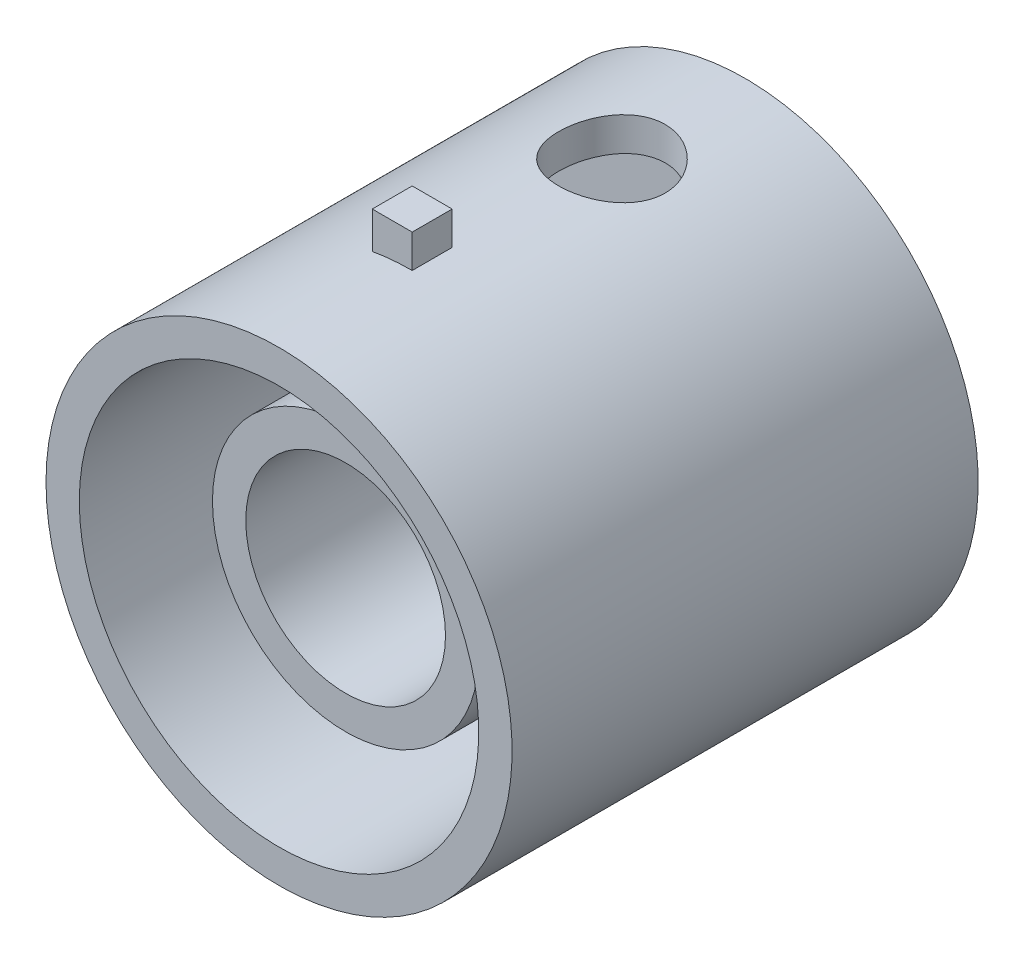
ISO-10303-21;
HEADER;
FILE_DESCRIPTION(('STEP AP214'),'2;1');
FILE_NAME('part.step','',(''),(''),'','','');
FILE_SCHEMA(('AUTOMOTIVE_DESIGN { 1 0 10303 214 1 1 1 1 }'));
ENDSEC;
DATA;
#1=APPLICATION_CONTEXT('core data for automotive mechanical design processes');
#2=APPLICATION_PROTOCOL_DEFINITION('international standard','automotive_design',2000,#1);
#3=PRODUCT_CONTEXT('',#1,'mechanical');
#4=PRODUCT('Part','Part','',(#3));
#5=PRODUCT_RELATED_PRODUCT_CATEGORY('part','',(#4));
#6=PRODUCT_DEFINITION_FORMATION('','',#4);
#7=PRODUCT_DEFINITION_CONTEXT('part definition',#1,'design');
#8=PRODUCT_DEFINITION('design','',#6,#7);
#9=PRODUCT_DEFINITION_SHAPE('','',#8);
#10=(LENGTH_UNIT() NAMED_UNIT(*) SI_UNIT(.MILLI.,.METRE.));
#11=(NAMED_UNIT(*) PLANE_ANGLE_UNIT() SI_UNIT($,.RADIAN.));
#12=(NAMED_UNIT(*) SI_UNIT($,.STERADIAN.) SOLID_ANGLE_UNIT());
#13=UNCERTAINTY_MEASURE_WITH_UNIT(LENGTH_MEASURE(1.E-05),#10,'distance_accuracy_value','');
#14=(GEOMETRIC_REPRESENTATION_CONTEXT(3) GLOBAL_UNCERTAINTY_ASSIGNED_CONTEXT((#13)) GLOBAL_UNIT_ASSIGNED_CONTEXT((#10,
#11,#12)) REPRESENTATION_CONTEXT('',''));
#15=CARTESIAN_POINT('',(0.,0.,0.));
#16=DIRECTION('',(0.,0.,1.));
#17=DIRECTION('',(1.,0.,0.));
#18=AXIS2_PLACEMENT_3D('',#15,#16,#17);
#19=CARTESIAN_POINT('',(0.,0.,35.));
#20=DIRECTION('',(0.,0.,-1.));
#21=DIRECTION('',(-1.,0.,0.));
#22=AXIS2_PLACEMENT_3D('',#19,#20,#21);
#23=CYLINDRICAL_SURFACE('',#22,15.);
#24=CARTESIAN_POINT('',(0.,0.,35.));
#25=DIRECTION('',(0.,0.,-1.));
#26=DIRECTION('',(-1.,0.,0.));
#27=AXIS2_PLACEMENT_3D('',#24,#25,#26);
#28=CIRCLE('',#27,15.);
#29=CARTESIAN_POINT('',(-15.,0.,35.));
#30=VERTEX_POINT('',#29);
#31=EDGE_CURVE('E215',#30,#30,#28,.T.);
#32=ORIENTED_EDGE('',*,*,#31,.F.);
#33=EDGE_LOOP('',(#32));
#34=FACE_BOUND('',#33,.T.);
#35=CARTESIAN_POINT('',(0.,0.,5.));
#36=DIRECTION('',(0.,0.,-1.));
#37=DIRECTION('',(-1.,0.,0.));
#38=AXIS2_PLACEMENT_3D('',#35,#36,#37);
#39=CIRCLE('',#38,15.);
#40=CARTESIAN_POINT('',(-15.,0.,5.));
#41=VERTEX_POINT('',#40);
#42=EDGE_CURVE('E219',#41,#41,#39,.T.);
#43=ORIENTED_EDGE('',*,*,#42,.T.);
#44=EDGE_LOOP('',(#43));
#45=FACE_BOUND('',#44,.T.);
#46=CARTESIAN_POINT('',(0.,15.,6.));
#47=CARTESIAN_POINT('',(-0.220509111665708,14.9999966762032,6.00000523386971));
#48=CARTESIAN_POINT('',(-0.44107432044368,14.995089723243,6.01829522837935));
#49=CARTESIAN_POINT('',(-0.875850902708927,14.9759914724332,6.09084246147739));
#50=CARTESIAN_POINT('',(-1.09005916663817,14.9617957066517,6.14511700885223));
#51=CARTESIAN_POINT('',(-1.50578317809062,14.9256866650558,6.28774333372807));
#52=CARTESIAN_POINT('',(-1.70731490203057,14.9037833426075,6.37605117533204));
#53=CARTESIAN_POINT('',(-2.09270737278532,14.8545739830336,6.58407448533324));
#54=CARTESIAN_POINT('',(-2.27656694089925,14.8272675859036,6.70379204671858));
#55=CARTESIAN_POINT('',(-2.62565900748003,14.7694922980399,6.97416703282674));
#56=CARTESIAN_POINT('',(-2.79042337972557,14.7389693535736,7.12541733601653));
#57=CARTESIAN_POINT('',(-3.09257427321275,14.6785481935918,7.45329696612671));
#58=CARTESIAN_POINT('',(-3.22995726991329,14.6486500589449,7.62992955523505));
#59=CARTESIAN_POINT('',(-3.4757281848683,14.5923107492874,8.0072964696509));
#60=CARTESIAN_POINT('',(-3.58357755472975,14.5659377712648,8.20839265652346));
#61=CARTESIAN_POINT('',(-3.76375096153988,14.5204295463637,8.62668022218485));
#62=CARTESIAN_POINT('',(-3.83608154902738,14.5012929650653,8.84386862466288));
#63=CARTESIAN_POINT('',(-3.94153840453008,14.472982316048,9.28299107565003));
#64=CARTESIAN_POINT('',(-3.97551340489383,14.4635929562298,9.50470707986147));
#65=CARTESIAN_POINT('',(-4.00594069411639,14.4551966183274,9.95087536661308));
#66=CARTESIAN_POINT('',(-4.00239999411507,14.4561877002889,10.1753271300481));
#67=CARTESIAN_POINT('',(-3.95857020005398,14.4682475760406,10.6139708307481));
#68=CARTESIAN_POINT('',(-3.91930812129529,14.4790347102306,10.828274364077));
#69=CARTESIAN_POINT('',(-3.80679497444366,14.5090202616138,11.2471366689125));
#70=CARTESIAN_POINT('',(-3.7335411898599,14.5282193510522,11.4516946601507));
#71=CARTESIAN_POINT('',(-3.55428713930512,14.5731132349677,11.8479362876172));
#72=CARTESIAN_POINT('',(-3.44792682275569,14.5988788563741,12.0394486785725));
#73=CARTESIAN_POINT('',(-3.20573007647555,14.6539645928489,12.4022683177031));
#74=CARTESIAN_POINT('',(-3.06988784448503,14.6832854071037,12.5735715783129));
#75=CARTESIAN_POINT('',(-2.76733214526838,14.7433502125973,12.8969779949096));
#76=CARTESIAN_POINT('',(-2.59975625456598,14.7741094297766,13.0482726366299));
#77=CARTESIAN_POINT('',(-2.24123533641274,14.8327276255263,13.3207775607006));
#78=CARTESIAN_POINT('',(-2.05028938841018,14.8605864897711,13.4419866574049));
#79=CARTESIAN_POINT('',(-1.6491965109949,14.9104364079659,13.6512358056493));
#80=CARTESIAN_POINT('',(-1.43896980510358,14.9324014566712,13.7391295408972));
#81=CARTESIAN_POINT('',(-1.00600458878079,14.96780088802,13.8780943776267));
#82=CARTESIAN_POINT('',(-0.783268823856647,14.981237134675,13.9291735254479));
#83=CARTESIAN_POINT('',(-0.338508166291031,14.9977831711677,13.9917897538357));
#84=CARTESIAN_POINT('',(-0.116648475282761,15.0011799494192,14.0044260797017));
#85=CARTESIAN_POINT('',(0.326020091802396,14.9980894338339,13.9928336715061));
#86=CARTESIAN_POINT('',(0.546829074124226,14.9916031616071,13.9686087477885));
#87=CARTESIAN_POINT('',(0.977204899803558,14.9696607099204,13.88488310508));
#88=CARTESIAN_POINT('',(1.18689970405556,14.9543605309265,13.8259955076045));
#89=CARTESIAN_POINT('',(1.59341394235213,14.9165258978828,13.6753281109841));
#90=CARTESIAN_POINT('',(1.79023197843205,14.8939906599234,13.5835447474989));
#91=CARTESIAN_POINT('',(2.1696769493359,14.8435132111904,13.3676522256389));
#92=CARTESIAN_POINT('',(2.35195037692236,14.8154737320985,13.2429450664045));
#93=CARTESIAN_POINT('',(2.6933692707943,14.7572290473119,12.965496739684));
#94=CARTESIAN_POINT('',(2.85251015759837,14.7270234145527,12.8127500347979));
#95=CARTESIAN_POINT('',(3.14777848957546,14.6667949173317,12.4784288450108));
#96=CARTESIAN_POINT('',(3.28313038499627,14.6368012285772,12.2961628772095));
#97=CARTESIAN_POINT('',(3.52134382370242,14.5813289436636,11.9108706078009));
#98=CARTESIAN_POINT('',(3.62420672244342,14.5558501591602,11.7078451727561));
#99=CARTESIAN_POINT('',(3.79374823172204,14.5125853674305,11.2878093858471));
#100=CARTESIAN_POINT('',(3.8606362450784,14.4947549662348,11.0708883763624));
#101=CARTESIAN_POINT('',(3.95682410237657,14.4687965026614,10.6283213606529));
#102=CARTESIAN_POINT('',(3.98613355205236,14.4606659608681,10.4026775993132));
#103=CARTESIAN_POINT('',(4.00577979307212,14.4552348910192,9.95701042421141));
#104=CARTESIAN_POINT('',(3.99736311235129,14.4575879532022,9.73704535942668));
#105=CARTESIAN_POINT('',(3.94468751999858,14.4720479199639,9.3017929719295));
#106=CARTESIAN_POINT('',(3.9004295306998,14.4841545735456,9.08650552899045));
#107=CARTESIAN_POINT('',(3.77805031399794,14.5165514219021,8.66828849575977));
#108=CARTESIAN_POINT('',(3.70019322151266,14.5367777005106,8.46527631454086));
#109=CARTESIAN_POINT('',(3.51303109124666,14.5831363626058,8.0750423389265));
#110=CARTESIAN_POINT('',(3.40372112049204,14.6092696723953,7.8878230273976));
#111=CARTESIAN_POINT('',(3.15297818537663,14.6654584288421,7.52853928100823));
#112=CARTESIAN_POINT('',(3.01069459535826,14.6956066620426,7.35708293004797));
#113=CARTESIAN_POINT('',(2.69966107022192,14.7559100756513,7.04007509666496));
#114=CARTESIAN_POINT('',(2.53090470871747,14.7860652559664,6.89452992266221));
#115=CARTESIAN_POINT('',(2.16735996217739,14.8437562480818,6.63041552470639));
#116=CARTESIAN_POINT('',(1.97209192350356,14.8712222262917,6.51248997870138));
#117=CARTESIAN_POINT('',(1.56377728083377,14.9196762020573,6.31132516814125));
#118=CARTESIAN_POINT('',(1.35074218939259,14.9406683536717,6.2280636486728));
#119=CARTESIAN_POINT('',(0.948749409761982,14.9710950502695,6.10944942916897));
#120=CARTESIAN_POINT('',(0.761524033130071,14.9818554118521,6.06850123281501));
#121=CARTESIAN_POINT('',(0.382879590634151,14.9963089807291,6.01377558766588));
#122=CARTESIAN_POINT('',(0.19146094080972,15.0000028859454,5.99999545559995));
#123=CARTESIAN_POINT('',(0.,15.,6.));
#124=B_SPLINE_CURVE_WITH_KNOTS('',3,(#46,#47,#48,#49,#50,#51,#52,#53,#54,#55,#56,#57,#58,#59,
#60,#61,#62,#63,#64,#65,#66,#67,#68,#69,#70,#71,#72,#73,#74,#75,#76,#77,#78,#79,#80,#81,#82,#83,
#84,#85,#86,#87,#88,#89,#90,#91,#92,#93,#94,#95,#96,#97,#98,#99,#100,#101,#102,#103,#104,#105,
#106,#107,#108,#109,#110,#111,#112,#113,#114,#115,#116,#117,#118,#119,#120,#121,#122,#123),
.UNSPECIFIED.,.T.,.F.,(4,2,2,2,2,2,2,2,2,2,2,2,2,2,2,2,2,2,2,2,2,2,2,2,2,2,2,2,2,2,2,2,2,2,2,2,
2,2,4),(0.,0.660825197899138,1.3219684875229,1.98226110594386,2.6425977341735,3.31669795909934,
3.99088489850298,4.67665165046458,5.36229188259399,6.03244316500936,6.70246920808639,
7.35382004091993,8.00522293625879,8.66397346692996,9.32285376235259,10.0032251962464,
10.6836234387519,11.3669761920608,12.0501795438028,12.7136543504909,13.377060578507,
14.0290707128423,14.6811515155123,15.346005720091,16.0109913651777,16.6947299276558,
17.3784399604821,18.0581259539877,18.7376381732796,19.394866848109,20.0520786104837,
20.7042153090379,21.3564543425319,22.0278867914997,22.6994824867208,23.3854450456898,
24.0709665229755,24.6447963799386,25.2185695593995),.UNSPECIFIED.);
#125=CARTESIAN_POINT('',(0.,15.,6.));
#126=VERTEX_POINT('',#125);
#127=EDGE_CURVE('E162',#126,#126,#124,.T.);
#128=ORIENTED_EDGE('',*,*,#127,.T.);
#129=EDGE_LOOP('',(#128));
#130=FACE_BOUND('',#129,.T.);
#131=ADVANCED_FACE('F54',(#34,#45,#130),#23,.F.);
#132=CARTESIAN_POINT('',(0.,0.,35.));
#133=DIRECTION('',(0.,0.,-1.));
#134=DIRECTION('',(-1.,0.,0.));
#135=AXIS2_PLACEMENT_3D('',#132,#133,#134);
#136=CYLINDRICAL_SURFACE('',#135,17.5);
#137=CARTESIAN_POINT('',(0.,0.,0.));
#138=DIRECTION('',(0.,0.,-1.));
#139=DIRECTION('',(-1.,0.,0.));
#140=AXIS2_PLACEMENT_3D('',#137,#138,#139);
#141=CIRCLE('',#140,17.5);
#142=CARTESIAN_POINT('',(-17.5,0.,0.));
#143=VERTEX_POINT('',#142);
#144=EDGE_CURVE('E207',#143,#143,#141,.T.);
#145=ORIENTED_EDGE('',*,*,#144,.F.);
#146=EDGE_LOOP('',(#145));
#147=FACE_BOUND('',#146,.T.);
#148=CARTESIAN_POINT('',(0.,0.,35.));
#149=DIRECTION('',(0.,0.,-1.));
#150=DIRECTION('',(-1.,0.,0.));
#151=AXIS2_PLACEMENT_3D('',#148,#149,#150);
#152=CIRCLE('',#151,17.5);
#153=CARTESIAN_POINT('',(-17.5,0.,35.));
#154=VERTEX_POINT('',#153);
#155=EDGE_CURVE('E211',#154,#154,#152,.T.);
#156=ORIENTED_EDGE('',*,*,#155,.T.);
#157=EDGE_LOOP('',(#156));
#158=FACE_BOUND('',#157,.T.);
#159=CARTESIAN_POINT('',(0.,0.,22.));
#160=DIRECTION('',(0.,0.,-1.));
#161=DIRECTION('',(-1.,0.,0.));
#162=AXIS2_PLACEMENT_3D('',#159,#160,#161);
#163=CIRCLE('',#162,17.5);
#164=CARTESIAN_POINT('',(0.,17.5,22.));
#165=VERTEX_POINT('',#164);
#166=CARTESIAN_POINT('',(-3.,17.2409396495667,22.));
#167=VERTEX_POINT('',#166);
#168=EDGE_CURVE('E244',#165,#167,#163,.F.);
#169=ORIENTED_EDGE('',*,*,#168,.F.);
#170=DIRECTION('',(0.,0.,-1.));
#171=VECTOR('',#170,1.);
#172=CARTESIAN_POINT('',(0.,17.5,35.));
#173=LINE('',#172,#171);
#174=CARTESIAN_POINT('',(0.,17.5,25.));
#175=VERTEX_POINT('',#174);
#176=EDGE_CURVE('E238',#175,#165,#173,.T.);
#177=ORIENTED_EDGE('',*,*,#176,.F.);
#178=CARTESIAN_POINT('',(0.,0.,25.));
#179=DIRECTION('',(0.,0.,-1.));
#180=DIRECTION('',(-1.,0.,0.));
#181=AXIS2_PLACEMENT_3D('',#178,#179,#180);
#182=CIRCLE('',#181,17.5);
#183=CARTESIAN_POINT('',(-3.,17.2409396495667,25.));
#184=VERTEX_POINT('',#183);
#185=EDGE_CURVE('E234',#175,#184,#182,.F.);
#186=ORIENTED_EDGE('',*,*,#185,.T.);
#187=DIRECTION('',(0.,0.,-1.));
#188=VECTOR('',#187,1.);
#189=CARTESIAN_POINT('',(-3.,17.2409396495667,35.));
#190=LINE('',#189,#188);
#191=EDGE_CURVE('E241',#167,#184,#190,.F.);
#192=ORIENTED_EDGE('',*,*,#191,.F.);
#193=EDGE_LOOP('',(#169,#177,#186,#192));
#194=FACE_BOUND('',#193,.T.);
#195=CARTESIAN_POINT('',(0.,0.,22.));
#196=DIRECTION('',(0.,0.,-1.));
#197=DIRECTION('',(-1.,0.,0.));
#198=AXIS2_PLACEMENT_3D('',#195,#196,#197);
#199=CIRCLE('',#198,17.5);
#200=CARTESIAN_POINT('',(-3.,-17.2409396495667,22.));
#201=VERTEX_POINT('',#200);
#202=CARTESIAN_POINT('',(0.,-17.5,22.));
#203=VERTEX_POINT('',#202);
#204=EDGE_CURVE('E13',#201,#203,#199,.F.);
#205=ORIENTED_EDGE('',*,*,#204,.F.);
#206=DIRECTION('',(0.,0.,-1.));
#207=VECTOR('',#206,1.);
#208=CARTESIAN_POINT('',(-3.,-17.2409396495667,35.));
#209=LINE('',#208,#207);
#210=CARTESIAN_POINT('',(-3.,-17.2409396495667,25.));
#211=VERTEX_POINT('',#210);
#212=EDGE_CURVE('E69',#211,#201,#209,.T.);
#213=ORIENTED_EDGE('',*,*,#212,.F.);
#214=CARTESIAN_POINT('',(0.,0.,25.));
#215=DIRECTION('',(0.,0.,-1.));
#216=DIRECTION('',(-1.,0.,0.));
#217=AXIS2_PLACEMENT_3D('',#214,#215,#216);
#218=CIRCLE('',#217,17.5);
#219=CARTESIAN_POINT('',(0.,-17.5,25.));
#220=VERTEX_POINT('',#219);
#221=EDGE_CURVE('E247',#211,#220,#218,.F.);
#222=ORIENTED_EDGE('',*,*,#221,.T.);
#223=DIRECTION('',(0.,0.,-1.));
#224=VECTOR('',#223,1.);
#225=CARTESIAN_POINT('',(0.,-17.5,35.));
#226=LINE('',#225,#224);
#227=EDGE_CURVE('E251',#203,#220,#226,.F.);
#228=ORIENTED_EDGE('',*,*,#227,.F.);
#229=EDGE_LOOP('',(#205,#213,#222,#228));
#230=FACE_BOUND('',#229,.T.);
#231=CARTESIAN_POINT('',(0.,17.5,6.));
#232=CARTESIAN_POINT('',(0.221594935282783,17.499995968068,6.00000719840746));
#233=CARTESIAN_POINT('',(0.443274756959128,17.4957485358512,6.01847623471597));
#234=CARTESIAN_POINT('',(0.880320521290673,17.4792153051271,6.09177753277479));
#235=CARTESIAN_POINT('',(1.09568213303245,17.4669241214815,6.14663415565499));
#236=CARTESIAN_POINT('',(1.51371360660757,17.4356696772318,6.29088913749491));
#237=CARTESIAN_POINT('',(1.7163970515423,17.4167137065161,6.38024976670637));
#238=CARTESIAN_POINT('',(2.10389021634727,17.3741673572337,6.59085236871805));
#239=CARTESIAN_POINT('',(2.28870007051439,17.3505770134924,6.7120941019476));
#240=CARTESIAN_POINT('',(2.63842568761195,17.3008795298367,6.98525220984049));
#241=CARTESIAN_POINT('',(2.8029853970679,17.2747388181941,7.1376183686492));
#242=CARTESIAN_POINT('',(3.1044499115144,17.223119203773,7.46773538936754));
#243=CARTESIAN_POINT('',(3.24135206502983,17.1976403646508,7.64548868230576));
#244=CARTESIAN_POINT('',(3.48521732049751,17.1498961972962,8.02400656213501));
#245=CARTESIAN_POINT('',(3.59179558541503,17.1276737744502,8.22502498325686));
#246=CARTESIAN_POINT('',(3.76951731339888,17.0894428847913,8.64271187160798));
#247=CARTESIAN_POINT('',(3.84066543543489,17.0734336010283,8.85937827687622));
#248=CARTESIAN_POINT('',(3.94431902613062,17.0497845472768,9.29833190184522));
#249=CARTESIAN_POINT('',(3.9774579308818,17.0420077545908,9.52046199903834));
#250=CARTESIAN_POINT('',(4.00612307635684,17.035293111181,9.96725457890033));
#251=CARTESIAN_POINT('',(4.00165438345226,17.0363540698644,10.1919167163888));
#252=CARTESIAN_POINT('',(3.95573961410788,17.0470712601244,10.6326439188653));
#253=CARTESIAN_POINT('',(3.91503498212017,17.0565551364498,10.8487910593008));
#254=CARTESIAN_POINT('',(3.7989808959904,17.0827764200256,11.2711049365832));
#255=CARTESIAN_POINT('',(3.72362933860985,17.0995142676242,11.4772710666939));
#256=CARTESIAN_POINT('',(3.53975448878011,17.138523865828,11.8758258646808));
#257=CARTESIAN_POINT('',(3.43095096279258,17.1608420572298,12.0680805104346));
#258=CARTESIAN_POINT('',(3.18345740925708,17.2084698633587,12.4318752551479));
#259=CARTESIAN_POINT('',(3.04476295504351,17.2337799209123,12.6034122800757));
#260=CARTESIAN_POINT('',(2.73752505065933,17.2852750505473,12.9251654878448));
#261=CARTESIAN_POINT('',(2.56835251342571,17.3114666500678,13.0747805611737));
#262=CARTESIAN_POINT('',(2.20701546217961,17.3612295344905,13.3436196053461));
#263=CARTESIAN_POINT('',(2.01485045400194,17.3848007630533,13.4628429228231));
#264=CARTESIAN_POINT('',(1.61221242808024,17.4267550028416,13.6676840640452));
#265=CARTESIAN_POINT('',(1.4016950092806,17.4451249475635,13.7532174599674));
#266=CARTESIAN_POINT('',(0.968760585223054,17.4745105073269,13.8875246689492));
#267=CARTESIAN_POINT('',(0.746345479589441,17.485527292635,13.9363043315818));
#268=CARTESIAN_POINT('',(0.301080239392927,17.4987966671339,13.9948319789069));
#269=CARTESIAN_POINT('',(0.0783432719554244,17.5012334233894,14.0054002910742));
#270=CARTESIAN_POINT('',(-0.365714036026687,17.4975868145157,13.9894366706773));
#271=CARTESIAN_POINT('',(-0.58703448077231,17.4915040834974,13.9629074993023));
#272=CARTESIAN_POINT('',(-1.01921828270224,17.4716187460405,13.874181179832));
#273=CARTESIAN_POINT('',(-1.23017576869971,17.4579104431039,13.8124195096374));
#274=CARTESIAN_POINT('',(-1.63873374864027,17.4243107905876,13.6554689592337));
#275=CARTESIAN_POINT('',(-1.83633303329064,17.4044188821279,13.5602770574683));
#276=CARTESIAN_POINT('',(-2.21591921812758,17.3602077001317,13.337495264924));
#277=CARTESIAN_POINT('',(-2.39761969440068,17.3358251156802,13.2094302021116));
#278=CARTESIAN_POINT('',(-2.73724492155052,17.2854568565593,12.9251574270327));
#279=CARTESIAN_POINT('',(-2.89516627399103,17.2594709534956,12.7689456991294));
#280=CARTESIAN_POINT('',(-3.18603583539193,17.2081804262773,12.4290347366439));
#281=CARTESIAN_POINT('',(-3.31841356091017,17.1829002549519,12.2448429233595));
#282=CARTESIAN_POINT('',(-3.55036421684567,17.1364804485464,11.8563632212505));
#283=CARTESIAN_POINT('',(-3.64993860087588,17.115340630012,11.652076223424));
#284=CARTESIAN_POINT('',(-3.81275583687656,17.0798080231766,11.2303175047898));
#285=CARTESIAN_POINT('',(-3.87620881551104,17.0653763043275,11.0129303466466));
#286=CARTESIAN_POINT('',(-3.96558236920152,17.0448320064026,10.5702029459794));
#287=CARTESIAN_POINT('',(-3.99150958975625,17.038717954349,10.344864118872));
#288=CARTESIAN_POINT('',(-4.0047928491744,17.0356000555771,9.89839697706551));
#289=CARTESIAN_POINT('',(-3.99305540805986,17.0383820905001,9.67729665533734));
#290=CARTESIAN_POINT('',(-3.9333836212789,17.0522553971543,9.24031509907753));
#291=CARTESIAN_POINT('',(-3.88544978624981,17.0633465516653,9.02443379096346));
#292=CARTESIAN_POINT('',(-3.75520174667951,17.0924793729435,8.60481846015926));
#293=CARTESIAN_POINT('',(-3.67303100198937,17.1104920130225,8.4010377574185));
#294=CARTESIAN_POINT('',(-3.47676086584632,17.1514471657162,8.01002420328945));
#295=CARTESIAN_POINT('',(-3.3626578016596,17.1743902453407,7.82279325865276));
#296=CARTESIAN_POINT('',(-3.10280513424774,17.2232520455791,7.46575133378238));
#297=CARTESIAN_POINT('',(-2.95641450406339,17.2492251279843,7.29641424047297));
#298=CARTESIAN_POINT('',(-2.63742660785007,17.3008680931784,6.98441260097407));
#299=CARTESIAN_POINT('',(-2.46482325514099,17.3265379040506,6.84175426689248));
#300=CARTESIAN_POINT('',(-2.09530030913021,17.3751231383439,6.58517312157907));
#301=CARTESIAN_POINT('',(-1.89806528208061,17.3979933821164,6.4716955030268));
#302=CARTESIAN_POINT('',(-1.48683089541921,17.4379432084139,6.27968545758628));
#303=CARTESIAN_POINT('',(-1.27284515414195,17.4550274359953,6.20112498305501));
#304=CARTESIAN_POINT('',(-0.882343223138205,17.47858702453,6.09448611113966));
#305=CARTESIAN_POINT('',(-0.707870008416512,17.4865655617845,6.05912403316657));
#306=CARTESIAN_POINT('',(-0.355615969967494,17.4972735296406,6.01187870525145));
#307=CARTESIAN_POINT('',(-0.177835320323118,17.5000032357234,5.99999422310309));
#308=CARTESIAN_POINT('',(0.,17.5,6.));
#309=B_SPLINE_CURVE_WITH_KNOTS('',3,(#231,#232,#233,#234,#235,#236,#237,#238,#239,#240,#241,
#242,#243,#244,#245,#246,#247,#248,#249,#250,#251,#252,#253,#254,#255,#256,#257,#258,#259,#260,
#261,#262,#263,#264,#265,#266,#267,#268,#269,#270,#271,#272,#273,#274,#275,#276,#277,#278,#279,
#280,#281,#282,#283,#284,#285,#286,#287,#288,#289,#290,#291,#292,#293,#294,#295,#296,#297,#298,
#299,#300,#301,#302,#303,#304,#305,#306,#307,#308),.UNSPECIFIED.,.T.,.F.,(4,2,2,2,2,2,2,2,2,2,2,
2,2,2,2,2,2,2,2,2,2,2,2,2,2,2,2,2,2,2,2,2,2,2,2,2,2,2,4),(0.,0.664133636950417,1.32871235418463,
1.99256641063926,2.6564154787027,3.3306394824578,4.00492809209305,4.6874268949088,
5.36983592723062,6.04069914231538,6.71147198236624,7.3688273923675,8.02622271233902,
8.68928255518439,9.35244066073913,10.0313033386907,10.7101806097055,11.3907485024342,
12.071208055884,12.7369696485043,13.4026816907039,14.0603384109987,14.7180545882069,
15.3858732303227,16.0537872245365,16.7352268957805,17.4166363663565,18.0940403124228,
18.7713242812165,19.4324306212132,20.0935276348865,20.7518819365842,21.4103119908293,
22.0832282229975,22.7563009481092,23.4391031988252,24.1213559842544,24.6543673418573,
25.1873507239626),.UNSPECIFIED.);
#310=CARTESIAN_POINT('',(0.,17.5,6.));
#311=VERTEX_POINT('',#310);
#312=EDGE_CURVE('E58',#311,#311,#309,.T.);
#313=ORIENTED_EDGE('',*,*,#312,.T.);
#314=EDGE_LOOP('',(#313));
#315=FACE_BOUND('',#314,.T.);
#316=ADVANCED_FACE('F323',(#147,#158,#194,#230,#315),#136,.T.);
#317=CARTESIAN_POINT('',(0.,0.,35.));
#318=DIRECTION('',(0.,0.,-1.));
#319=DIRECTION('',(-1.,0.,0.));
#320=AXIS2_PLACEMENT_3D('',#317,#318,#319);
#321=CYLINDRICAL_SURFACE('',#320,7.5);
#322=CARTESIAN_POINT('',(0.,0.,5.));
#323=DIRECTION('',(0.,0.,-1.));
#324=DIRECTION('',(-1.,0.,0.));
#325=AXIS2_PLACEMENT_3D('',#322,#323,#324);
#326=CIRCLE('',#325,7.5);
#327=CARTESIAN_POINT('',(-7.5,0.,5.));
#328=VERTEX_POINT('',#327);
#329=EDGE_CURVE('E192',#328,#328,#326,.T.);
#330=ORIENTED_EDGE('',*,*,#329,.T.);
#331=EDGE_LOOP('',(#330));
#332=FACE_BOUND('',#331,.T.);
#333=CARTESIAN_POINT('',(0.,0.,30.));
#334=DIRECTION('',(0.,0.,-1.));
#335=DIRECTION('',(-1.,0.,0.));
#336=AXIS2_PLACEMENT_3D('',#333,#334,#335);
#337=CIRCLE('',#336,7.5);
#338=CARTESIAN_POINT('',(-7.5,0.,30.));
#339=VERTEX_POINT('',#338);
#340=EDGE_CURVE('E231',#339,#339,#337,.T.);
#341=ORIENTED_EDGE('',*,*,#340,.F.);
#342=EDGE_LOOP('',(#341));
#343=FACE_BOUND('',#342,.T.);
#344=ADVANCED_FACE('F56',(#332,#343),#321,.F.);
#345=CARTESIAN_POINT('',(10.,0.,30.));
#346=DIRECTION('',(0.,0.,1.));
#347=DIRECTION('',(1.,0.,0.));
#348=AXIS2_PLACEMENT_3D('',#345,#346,#347);
#349=PLANE('',#348);
#350=ORIENTED_EDGE('',*,*,#340,.T.);
#351=EDGE_LOOP('',(#350));
#352=FACE_BOUND('',#351,.T.);
#353=CARTESIAN_POINT('',(0.,0.,30.));
#354=DIRECTION('',(0.,0.,-1.));
#355=DIRECTION('',(-1.,0.,0.));
#356=AXIS2_PLACEMENT_3D('',#353,#354,#355);
#357=CIRCLE('',#356,10.);
#358=CARTESIAN_POINT('',(-10.,0.,30.));
#359=VERTEX_POINT('',#358);
#360=EDGE_CURVE('E227',#359,#359,#357,.T.);
#361=ORIENTED_EDGE('',*,*,#360,.F.);
#362=EDGE_LOOP('',(#361));
#363=FACE_BOUND('',#362,.T.);
#364=ADVANCED_FACE('F352',(#352,#363),#349,.T.);
#365=CARTESIAN_POINT('',(0.,0.,35.));
#366=DIRECTION('',(0.,0.,-1.));
#367=DIRECTION('',(-1.,0.,0.));
#368=AXIS2_PLACEMENT_3D('',#365,#366,#367);
#369=CYLINDRICAL_SURFACE('',#368,10.);
#370=ORIENTED_EDGE('',*,*,#360,.T.);
#371=EDGE_LOOP('',(#370));
#372=FACE_BOUND('',#371,.T.);
#373=CARTESIAN_POINT('',(0.,0.,5.));
#374=DIRECTION('',(0.,0.,-1.));
#375=DIRECTION('',(-1.,0.,0.));
#376=AXIS2_PLACEMENT_3D('',#373,#374,#375);
#377=CIRCLE('',#376,10.);
#378=CARTESIAN_POINT('',(-10.,0.,5.));
#379=VERTEX_POINT('',#378);
#380=EDGE_CURVE('E223',#379,#379,#377,.T.);
#381=ORIENTED_EDGE('',*,*,#380,.F.);
#382=EDGE_LOOP('',(#381));
#383=FACE_BOUND('',#382,.T.);
#384=ADVANCED_FACE('F333',(#372,#383),#369,.T.);
#385=CARTESIAN_POINT('',(15.,0.,5.));
#386=DIRECTION('',(0.,0.,1.));
#387=DIRECTION('',(1.,0.,0.));
#388=AXIS2_PLACEMENT_3D('',#385,#386,#387);
#389=PLANE('',#388);
#390=ORIENTED_EDGE('',*,*,#380,.T.);
#391=EDGE_LOOP('',(#390));
#392=FACE_BOUND('',#391,.T.);
#393=ORIENTED_EDGE('',*,*,#42,.F.);
#394=EDGE_LOOP('',(#393));
#395=FACE_BOUND('',#394,.T.);
#396=ADVANCED_FACE('F328',(#392,#395),#389,.T.);
#397=CARTESIAN_POINT('',(17.5,0.,35.));
#398=DIRECTION('',(0.,0.,1.));
#399=DIRECTION('',(1.,0.,0.));
#400=AXIS2_PLACEMENT_3D('',#397,#398,#399);
#401=PLANE('',#400);
#402=ORIENTED_EDGE('',*,*,#31,.T.);
#403=EDGE_LOOP('',(#402));
#404=FACE_BOUND('',#403,.T.);
#405=ORIENTED_EDGE('',*,*,#155,.F.);
#406=EDGE_LOOP('',(#405));
#407=FACE_BOUND('',#406,.T.);
#408=ADVANCED_FACE('F321',(#404,#407),#401,.T.);
#409=CARTESIAN_POINT('',(15.,0.,0.));
#410=DIRECTION('',(0.,0.,-1.));
#411=DIRECTION('',(-1.,0.,0.));
#412=AXIS2_PLACEMENT_3D('',#409,#410,#411);
#413=PLANE('',#412);
#414=ORIENTED_EDGE('',*,*,#144,.T.);
#415=EDGE_LOOP('',(#414));
#416=FACE_BOUND('',#415,.T.);
#417=CARTESIAN_POINT('',(0.,0.,0.));
#418=DIRECTION('',(0.,0.,-1.));
#419=DIRECTION('',(-1.,0.,0.));
#420=AXIS2_PLACEMENT_3D('',#417,#418,#419);
#421=CIRCLE('',#420,15.);
#422=CARTESIAN_POINT('',(-15.,0.,0.));
#423=VERTEX_POINT('',#422);
#424=EDGE_CURVE('E203',#423,#423,#421,.T.);
#425=ORIENTED_EDGE('',*,*,#424,.F.);
#426=EDGE_LOOP('',(#425));
#427=FACE_BOUND('',#426,.T.);
#428=ADVANCED_FACE('F318',(#416,#427),#413,.T.);
#429=CARTESIAN_POINT('',(0.,0.,35.));
#430=DIRECTION('',(0.,0.,-1.));
#431=DIRECTION('',(-1.,0.,0.));
#432=AXIS2_PLACEMENT_3D('',#429,#430,#431);
#433=CYLINDRICAL_SURFACE('',#432,15.);
#434=ORIENTED_EDGE('',*,*,#424,.T.);
#435=EDGE_LOOP('',(#434));
#436=FACE_BOUND('',#435,.T.);
#437=CARTESIAN_POINT('',(0.,0.,3.));
#438=DIRECTION('',(0.,0.,-1.));
#439=DIRECTION('',(-1.,0.,0.));
#440=AXIS2_PLACEMENT_3D('',#437,#438,#439);
#441=CIRCLE('',#440,15.);
#442=CARTESIAN_POINT('',(-15.,0.,3.));
#443=VERTEX_POINT('',#442);
#444=EDGE_CURVE('E199',#443,#443,#441,.T.);
#445=ORIENTED_EDGE('',*,*,#444,.F.);
#446=EDGE_LOOP('',(#445));
#447=FACE_BOUND('',#446,.T.);
#448=ADVANCED_FACE('F314',(#436,#447),#433,.F.);
#449=CARTESIAN_POINT('',(0.,0.,3.));
#450=DIRECTION('',(0.,0.,-1.));
#451=DIRECTION('',(-1.,0.,0.));
#452=AXIS2_PLACEMENT_3D('',#449,#450,#451);
#453=PLANE('',#452);
#454=ORIENTED_EDGE('',*,*,#444,.T.);
#455=EDGE_LOOP('',(#454));
#456=FACE_BOUND('',#455,.T.);
#457=ADVANCED_FACE('F310',(#456),#453,.T.);
#458=CARTESIAN_POINT('',(7.5,0.,5.));
#459=DIRECTION('',(0.,0.,1.));
#460=DIRECTION('',(1.,0.,0.));
#461=AXIS2_PLACEMENT_3D('',#458,#459,#460);
#462=PLANE('',#461);
#463=ORIENTED_EDGE('',*,*,#329,.F.);
#464=EDGE_LOOP('',(#463));
#465=FACE_BOUND('',#464,.T.);
#466=ADVANCED_FACE('F306',(#465),#462,.T.);
#467=CARTESIAN_POINT('',(-3.,15.,22.));
#468=DIRECTION('',(-1.,0.,0.));
#469=DIRECTION('',(0.,0.,1.));
#470=AXIS2_PLACEMENT_3D('',#467,#468,#469);
#471=PLANE('',#470);
#472=DIRECTION('',(0.,-1.,0.));
#473=VECTOR('',#472,1.);
#474=CARTESIAN_POINT('',(-3.,15.,22.));
#475=LINE('',#474,#473);
#476=CARTESIAN_POINT('',(-3.,20.,22.));
#477=VERTEX_POINT('',#476);
#478=EDGE_CURVE('E169',#477,#167,#475,.T.);
#479=ORIENTED_EDGE('',*,*,#478,.T.);
#480=ORIENTED_EDGE('',*,*,#191,.T.);
#481=DIRECTION('',(0.,-1.,0.));
#482=VECTOR('',#481,1.);
#483=CARTESIAN_POINT('',(-3.,15.,25.));
#484=LINE('',#483,#482);
#485=CARTESIAN_POINT('',(-3.,20.,25.));
#486=VERTEX_POINT('',#485);
#487=EDGE_CURVE('E84',#486,#184,#484,.T.);
#488=ORIENTED_EDGE('',*,*,#487,.F.);
#489=DIRECTION('',(0.,0.,1.));
#490=VECTOR('',#489,1.);
#491=CARTESIAN_POINT('',(-3.,20.,22.));
#492=LINE('',#491,#490);
#493=EDGE_CURVE('E189',#477,#486,#492,.T.);
#494=ORIENTED_EDGE('',*,*,#493,.F.);
#495=EDGE_LOOP('',(#479,#480,#488,#494));
#496=FACE_BOUND('',#495,.T.);
#497=ADVANCED_FACE('F299',(#496),#471,.T.);
#498=CARTESIAN_POINT('',(-3.,20.,22.));
#499=DIRECTION('',(0.,1.,0.));
#500=DIRECTION('',(0.,0.,1.));
#501=AXIS2_PLACEMENT_3D('',#498,#499,#500);
#502=PLANE('',#501);
#503=DIRECTION('',(-1.,0.,0.));
#504=VECTOR('',#503,1.);
#505=CARTESIAN_POINT('',(-3.,20.,25.));
#506=LINE('',#505,#504);
#507=CARTESIAN_POINT('',(0.,20.,25.));
#508=VERTEX_POINT('',#507);
#509=EDGE_CURVE('E174',#508,#486,#506,.T.);
#510=ORIENTED_EDGE('',*,*,#509,.F.);
#511=DIRECTION('',(0.,0.,1.));
#512=VECTOR('',#511,1.);
#513=CARTESIAN_POINT('',(0.,20.,22.));
#514=LINE('',#513,#512);
#515=CARTESIAN_POINT('',(0.,20.,22.));
#516=VERTEX_POINT('',#515);
#517=EDGE_CURVE('E181',#516,#508,#514,.T.);
#518=ORIENTED_EDGE('',*,*,#517,.F.);
#519=DIRECTION('',(-1.,0.,0.));
#520=VECTOR('',#519,1.);
#521=CARTESIAN_POINT('',(-3.,20.,22.));
#522=LINE('',#521,#520);
#523=EDGE_CURVE('E177',#516,#477,#522,.T.);
#524=ORIENTED_EDGE('',*,*,#523,.T.);
#525=ORIENTED_EDGE('',*,*,#493,.T.);
#526=EDGE_LOOP('',(#510,#518,#524,#525));
#527=FACE_BOUND('',#526,.T.);
#528=ADVANCED_FACE('F296',(#527),#502,.T.);
#529=CARTESIAN_POINT('',(0.,15.,22.));
#530=DIRECTION('',(1.,0.,0.));
#531=DIRECTION('',(0.,0.,-1.));
#532=AXIS2_PLACEMENT_3D('',#529,#530,#531);
#533=PLANE('',#532);
#534=DIRECTION('',(0.,1.,0.));
#535=VECTOR('',#534,1.);
#536=CARTESIAN_POINT('',(0.,15.,25.));
#537=LINE('',#536,#535);
#538=EDGE_CURVE('E184',#175,#508,#537,.T.);
#539=ORIENTED_EDGE('',*,*,#538,.F.);
#540=ORIENTED_EDGE('',*,*,#176,.T.);
#541=DIRECTION('',(0.,1.,0.));
#542=VECTOR('',#541,1.);
#543=CARTESIAN_POINT('',(0.,15.,22.));
#544=LINE('',#543,#542);
#545=EDGE_CURVE('E173',#165,#516,#544,.T.);
#546=ORIENTED_EDGE('',*,*,#545,.T.);
#547=ORIENTED_EDGE('',*,*,#517,.T.);
#548=EDGE_LOOP('',(#539,#540,#546,#547));
#549=FACE_BOUND('',#548,.T.);
#550=ADVANCED_FACE('F292',(#549),#533,.T.);
#551=CARTESIAN_POINT('',(0.,0.,22.));
#552=DIRECTION('',(0.,0.,-1.));
#553=DIRECTION('',(-1.,0.,0.));
#554=AXIS2_PLACEMENT_3D('',#551,#552,#553);
#555=PLANE('',#554);
#556=ORIENTED_EDGE('',*,*,#545,.F.);
#557=ORIENTED_EDGE('',*,*,#168,.T.);
#558=ORIENTED_EDGE('',*,*,#478,.F.);
#559=ORIENTED_EDGE('',*,*,#523,.F.);
#560=EDGE_LOOP('',(#556,#557,#558,#559));
#561=FACE_BOUND('',#560,.T.);
#562=ADVANCED_FACE('F289',(#561),#555,.T.);
#563=CARTESIAN_POINT('',(0.,0.,25.));
#564=DIRECTION('',(0.,0.,-1.));
#565=DIRECTION('',(-1.,0.,0.));
#566=AXIS2_PLACEMENT_3D('',#563,#564,#565);
#567=PLANE('',#566);
#568=ORIENTED_EDGE('',*,*,#185,.F.);
#569=ORIENTED_EDGE('',*,*,#538,.T.);
#570=ORIENTED_EDGE('',*,*,#509,.T.);
#571=ORIENTED_EDGE('',*,*,#487,.T.);
#572=EDGE_LOOP('',(#568,#569,#570,#571));
#573=FACE_BOUND('',#572,.T.);
#574=ADVANCED_FACE('F288',(#573),#567,.F.);
#575=CARTESIAN_POINT('',(-3.,-20.,22.));
#576=DIRECTION('',(-1.,0.,0.));
#577=DIRECTION('',(0.,0.,1.));
#578=AXIS2_PLACEMENT_3D('',#575,#576,#577);
#579=PLANE('',#578);
#580=DIRECTION('',(0.,-1.,0.));
#581=VECTOR('',#580,1.);
#582=CARTESIAN_POINT('',(-3.,-20.,25.));
#583=LINE('',#582,#581);
#584=CARTESIAN_POINT('',(-3.,-20.,25.));
#585=VERTEX_POINT('',#584);
#586=EDGE_CURVE('E159',#211,#585,#583,.T.);
#587=ORIENTED_EDGE('',*,*,#586,.F.);
#588=ORIENTED_EDGE('',*,*,#212,.T.);
#589=DIRECTION('',(0.,-1.,0.));
#590=VECTOR('',#589,1.);
#591=CARTESIAN_POINT('',(-3.,-20.,22.));
#592=LINE('',#591,#590);
#593=CARTESIAN_POINT('',(-3.,-20.,22.));
#594=VERTEX_POINT('',#593);
#595=EDGE_CURVE('E127',#201,#594,#592,.T.);
#596=ORIENTED_EDGE('',*,*,#595,.T.);
#597=DIRECTION('',(0.,0.,1.));
#598=VECTOR('',#597,1.);
#599=CARTESIAN_POINT('',(-3.,-20.,22.));
#600=LINE('',#599,#598);
#601=EDGE_CURVE('E131',#594,#585,#600,.T.);
#602=ORIENTED_EDGE('',*,*,#601,.T.);
#603=EDGE_LOOP('',(#587,#588,#596,#602));
#604=FACE_BOUND('',#603,.T.);
#605=ADVANCED_FACE('F130',(#604),#579,.T.);
#606=CARTESIAN_POINT('',(0.,-20.,22.));
#607=DIRECTION('',(1.,0.,0.));
#608=DIRECTION('',(0.,0.,-1.));
#609=AXIS2_PLACEMENT_3D('',#606,#607,#608);
#610=PLANE('',#609);
#611=DIRECTION('',(0.,1.,0.));
#612=VECTOR('',#611,1.);
#613=CARTESIAN_POINT('',(0.,-20.,22.));
#614=LINE('',#613,#612);
#615=CARTESIAN_POINT('',(0.,-20.,22.));
#616=VERTEX_POINT('',#615);
#617=EDGE_CURVE('E146',#616,#203,#614,.T.);
#618=ORIENTED_EDGE('',*,*,#617,.T.);
#619=ORIENTED_EDGE('',*,*,#227,.T.);
#620=DIRECTION('',(0.,1.,0.));
#621=VECTOR('',#620,1.);
#622=CARTESIAN_POINT('',(0.,-20.,25.));
#623=LINE('',#622,#621);
#624=CARTESIAN_POINT('',(0.,-20.,25.));
#625=VERTEX_POINT('',#624);
#626=EDGE_CURVE('E76',#625,#220,#623,.T.);
#627=ORIENTED_EDGE('',*,*,#626,.F.);
#628=DIRECTION('',(0.,0.,1.));
#629=VECTOR('',#628,1.);
#630=CARTESIAN_POINT('',(0.,-20.,22.));
#631=LINE('',#630,#629);
#632=EDGE_CURVE('E145',#616,#625,#631,.T.);
#633=ORIENTED_EDGE('',*,*,#632,.F.);
#634=EDGE_LOOP('',(#618,#619,#627,#633));
#635=FACE_BOUND('',#634,.T.);
#636=ADVANCED_FACE('F280',(#635),#610,.T.);
#637=CARTESIAN_POINT('',(-3.,-20.,22.));
#638=DIRECTION('',(0.,-1.,0.));
#639=DIRECTION('',(0.,0.,-1.));
#640=AXIS2_PLACEMENT_3D('',#637,#638,#639);
#641=PLANE('',#640);
#642=DIRECTION('',(1.,0.,0.));
#643=VECTOR('',#642,1.);
#644=CARTESIAN_POINT('',(-3.,-20.,25.));
#645=LINE('',#644,#643);
#646=EDGE_CURVE('E143',#585,#625,#645,.T.);
#647=ORIENTED_EDGE('',*,*,#646,.F.);
#648=ORIENTED_EDGE('',*,*,#601,.F.);
#649=DIRECTION('',(1.,0.,0.));
#650=VECTOR('',#649,1.);
#651=CARTESIAN_POINT('',(-3.,-20.,22.));
#652=LINE('',#651,#650);
#653=EDGE_CURVE('E138',#594,#616,#652,.T.);
#654=ORIENTED_EDGE('',*,*,#653,.T.);
#655=ORIENTED_EDGE('',*,*,#632,.T.);
#656=EDGE_LOOP('',(#647,#648,#654,#655));
#657=FACE_BOUND('',#656,.T.);
#658=ADVANCED_FACE('F142',(#657),#641,.T.);
#659=CARTESIAN_POINT('',(0.,0.,22.));
#660=DIRECTION('',(0.,0.,-1.));
#661=DIRECTION('',(-1.,0.,0.));
#662=AXIS2_PLACEMENT_3D('',#659,#660,#661);
#663=PLANE('',#662);
#664=ORIENTED_EDGE('',*,*,#595,.F.);
#665=ORIENTED_EDGE('',*,*,#204,.T.);
#666=ORIENTED_EDGE('',*,*,#617,.F.);
#667=ORIENTED_EDGE('',*,*,#653,.F.);
#668=EDGE_LOOP('',(#664,#665,#666,#667));
#669=FACE_BOUND('',#668,.T.);
#670=ADVANCED_FACE('F149',(#669),#663,.T.);
#671=CARTESIAN_POINT('',(0.,0.,25.));
#672=DIRECTION('',(0.,0.,-1.));
#673=DIRECTION('',(-1.,0.,0.));
#674=AXIS2_PLACEMENT_3D('',#671,#672,#673);
#675=PLANE('',#674);
#676=ORIENTED_EDGE('',*,*,#221,.F.);
#677=ORIENTED_EDGE('',*,*,#586,.T.);
#678=ORIENTED_EDGE('',*,*,#646,.T.);
#679=ORIENTED_EDGE('',*,*,#626,.T.);
#680=EDGE_LOOP('',(#676,#677,#678,#679));
#681=FACE_BOUND('',#680,.T.);
#682=ADVANCED_FACE('F273',(#681),#675,.F.);
#683=CARTESIAN_POINT('',(0.,18.,10.));
#684=DIRECTION('',(0.,-1.,0.));
#685=DIRECTION('',(0.,0.,-1.));
#686=AXIS2_PLACEMENT_3D('',#683,#684,#685);
#687=CYLINDRICAL_SURFACE('',#686,4.);
#688=ORIENTED_EDGE('',*,*,#127,.F.);
#689=EDGE_LOOP('',(#688));
#690=FACE_BOUND('',#689,.T.);
#691=ORIENTED_EDGE('',*,*,#312,.F.);
#692=EDGE_LOOP('',(#691));
#693=FACE_BOUND('',#692,.T.);
#694=ADVANCED_FACE('F269',(#690,#693),#687,.F.);
#695=CLOSED_SHELL('',(#131,#316,#344,#364,#384,#396,#408,#428,#448,#457,#466,#497,#528,#550,
#562,#574,#605,#636,#658,#670,#682,#694));
#696=MANIFOLD_SOLID_BREP('B2',#695);
#697=ADVANCED_BREP_SHAPE_REPRESENTATION('',(#18,#696),#14);
#698=SHAPE_DEFINITION_REPRESENTATION(#9,#697);
ENDSEC;
END-ISO-10303-21;
